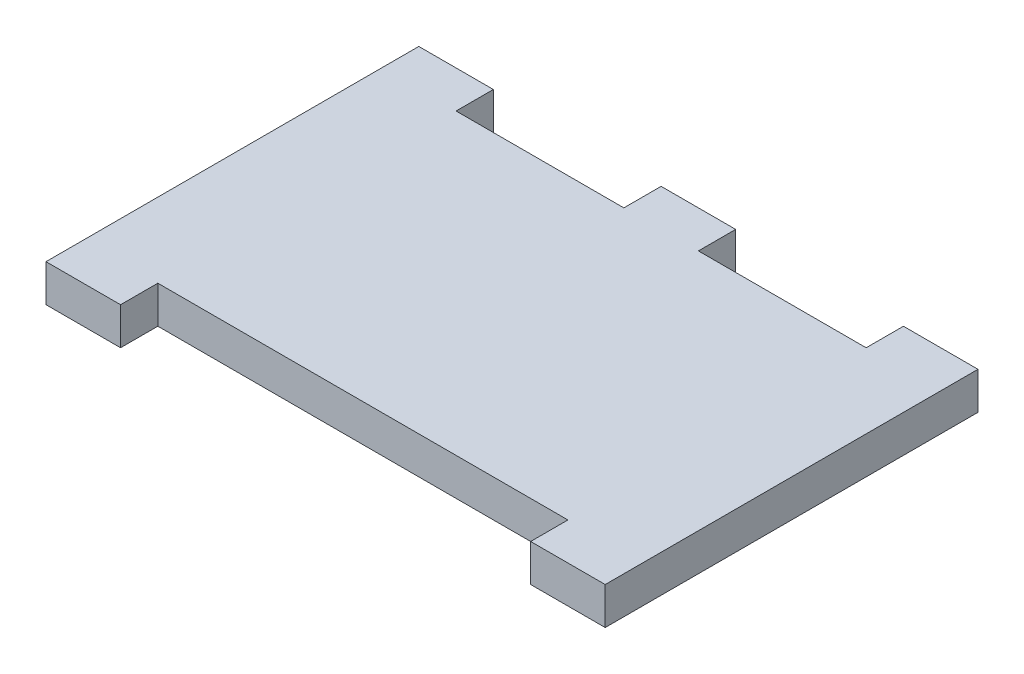
ISO-10303-21;
HEADER;
FILE_DESCRIPTION(('STEP AP214'),'2;1');
FILE_NAME('part.step','',(''),(''),'','','');
FILE_SCHEMA(('AUTOMOTIVE_DESIGN { 1 0 10303 214 1 1 1 1 }'));
ENDSEC;
DATA;
#1=APPLICATION_CONTEXT('core data for automotive mechanical design processes');
#2=APPLICATION_PROTOCOL_DEFINITION('international standard','automotive_design',2000,#1);
#3=PRODUCT_CONTEXT('',#1,'mechanical');
#4=PRODUCT('Part','Part','',(#3));
#5=PRODUCT_RELATED_PRODUCT_CATEGORY('part','',(#4));
#6=PRODUCT_DEFINITION_FORMATION('','',#4);
#7=PRODUCT_DEFINITION_CONTEXT('part definition',#1,'design');
#8=PRODUCT_DEFINITION('design','',#6,#7);
#9=PRODUCT_DEFINITION_SHAPE('','',#8);
#10=(LENGTH_UNIT() NAMED_UNIT(*) SI_UNIT(.MILLI.,.METRE.));
#11=(NAMED_UNIT(*) PLANE_ANGLE_UNIT() SI_UNIT($,.RADIAN.));
#12=(NAMED_UNIT(*) SI_UNIT($,.STERADIAN.) SOLID_ANGLE_UNIT());
#13=UNCERTAINTY_MEASURE_WITH_UNIT(LENGTH_MEASURE(1.E-05),#10,'distance_accuracy_value','');
#14=(GEOMETRIC_REPRESENTATION_CONTEXT(3) GLOBAL_UNCERTAINTY_ASSIGNED_CONTEXT((#13)) GLOBAL_UNIT_ASSIGNED_CONTEXT((#10,
#11,#12)) REPRESENTATION_CONTEXT('',''));
#15=CARTESIAN_POINT('',(0.,0.,0.));
#16=DIRECTION('',(0.,0.,1.));
#17=DIRECTION('',(1.,0.,0.));
#18=AXIS2_PLACEMENT_3D('',#15,#16,#17);
#19=CARTESIAN_POINT('',(0.,7.62,0.));
#20=DIRECTION('',(0.,0.,-1.));
#21=DIRECTION('',(-1.,0.,0.));
#22=AXIS2_PLACEMENT_3D('',#19,#20,#21);
#23=PLANE('',#22);
#24=DIRECTION('',(1.,0.,0.));
#25=VECTOR('',#24,1.);
#26=CARTESIAN_POINT('',(0.,0.,0.));
#27=LINE('',#26,#25);
#28=CARTESIAN_POINT('',(0.,0.,0.));
#29=VERTEX_POINT('',#28);
#30=CARTESIAN_POINT('',(15.24,0.,0.));
#31=VERTEX_POINT('',#30);
#32=EDGE_CURVE('E162',#29,#31,#27,.T.);
#33=ORIENTED_EDGE('',*,*,#32,.T.);
#34=DIRECTION('',(0.,1.,0.));
#35=VECTOR('',#34,1.);
#36=CARTESIAN_POINT('',(15.24,0.,0.));
#37=LINE('',#36,#35);
#38=CARTESIAN_POINT('',(15.24,7.62,0.));
#39=VERTEX_POINT('',#38);
#40=EDGE_CURVE('E146',#31,#39,#37,.T.);
#41=ORIENTED_EDGE('',*,*,#40,.T.);
#42=DIRECTION('',(1.,0.,0.));
#43=VECTOR('',#42,1.);
#44=CARTESIAN_POINT('',(0.,7.62,0.));
#45=LINE('',#44,#43);
#46=CARTESIAN_POINT('',(0.,7.62,0.));
#47=VERTEX_POINT('',#46);
#48=EDGE_CURVE('E255',#47,#39,#45,.T.);
#49=ORIENTED_EDGE('',*,*,#48,.F.);
#50=DIRECTION('',(0.,-1.,0.));
#51=VECTOR('',#50,1.);
#52=CARTESIAN_POINT('',(0.,7.62,0.));
#53=LINE('',#52,#51);
#54=EDGE_CURVE('E168',#47,#29,#53,.T.);
#55=ORIENTED_EDGE('',*,*,#54,.T.);
#56=EDGE_LOOP('',(#33,#41,#49,#55));
#57=FACE_BOUND('',#56,.T.);
#58=ADVANCED_FACE('F33',(#57),#23,.F.);
#59=CARTESIAN_POINT('',(0.,7.62,-76.2));
#60=DIRECTION('',(0.,0.,-1.));
#61=DIRECTION('',(-1.,0.,0.));
#62=AXIS2_PLACEMENT_3D('',#59,#60,#61);
#63=PLANE('',#62);
#64=DIRECTION('',(0.,1.,0.));
#65=VECTOR('',#64,1.);
#66=CARTESIAN_POINT('',(99.06,0.,-76.2));
#67=LINE('',#66,#65);
#68=CARTESIAN_POINT('',(99.06,0.,-76.2));
#69=VERTEX_POINT('',#68);
#70=CARTESIAN_POINT('',(99.06,7.62,-76.2));
#71=VERTEX_POINT('',#70);
#72=EDGE_CURVE('E227',#69,#71,#67,.T.);
#73=ORIENTED_EDGE('',*,*,#72,.T.);
#74=DIRECTION('',(1.,0.,0.));
#75=VECTOR('',#74,1.);
#76=CARTESIAN_POINT('',(0.,7.62,-76.2));
#77=LINE('',#76,#75);
#78=CARTESIAN_POINT('',(114.3,7.62,-76.2));
#79=VERTEX_POINT('',#78);
#80=EDGE_CURVE('E196',#71,#79,#77,.T.);
#81=ORIENTED_EDGE('',*,*,#80,.T.);
#82=DIRECTION('',(0.,-1.,0.));
#83=VECTOR('',#82,1.);
#84=CARTESIAN_POINT('',(114.3,7.62,-76.2));
#85=LINE('',#84,#83);
#86=CARTESIAN_POINT('',(114.3,0.,-76.2));
#87=VERTEX_POINT('',#86);
#88=EDGE_CURVE('E41',#79,#87,#85,.T.);
#89=ORIENTED_EDGE('',*,*,#88,.T.);
#90=DIRECTION('',(1.,0.,0.));
#91=VECTOR('',#90,1.);
#92=CARTESIAN_POINT('',(0.,0.,-76.2));
#93=LINE('',#92,#91);
#94=EDGE_CURVE('E173',#69,#87,#93,.T.);
#95=ORIENTED_EDGE('',*,*,#94,.F.);
#96=EDGE_LOOP('',(#73,#81,#89,#95));
#97=FACE_BOUND('',#96,.T.);
#98=ADVANCED_FACE('F194',(#97),#63,.T.);
#99=DIRECTION('',(0.,1.,0.));
#100=VECTOR('',#99,1.);
#101=CARTESIAN_POINT('',(15.24,0.,-76.2));
#102=LINE('',#101,#100);
#103=CARTESIAN_POINT('',(15.24,0.,-76.2));
#104=VERTEX_POINT('',#103);
#105=CARTESIAN_POINT('',(15.24,7.62,-76.2));
#106=VERTEX_POINT('',#105);
#107=EDGE_CURVE('E175',#104,#106,#102,.T.);
#108=ORIENTED_EDGE('',*,*,#107,.F.);
#109=CARTESIAN_POINT('',(0.,0.,-76.2));
#110=VERTEX_POINT('',#109);
#111=EDGE_CURVE('E180',#110,#104,#93,.T.);
#112=ORIENTED_EDGE('',*,*,#111,.F.);
#113=DIRECTION('',(0.,-1.,0.));
#114=VECTOR('',#113,1.);
#115=CARTESIAN_POINT('',(0.,7.62,-76.2));
#116=LINE('',#115,#114);
#117=CARTESIAN_POINT('',(0.,7.62,-76.2));
#118=VERTEX_POINT('',#117);
#119=EDGE_CURVE('E188',#118,#110,#116,.T.);
#120=ORIENTED_EDGE('',*,*,#119,.F.);
#121=EDGE_CURVE('E258',#118,#106,#77,.T.);
#122=ORIENTED_EDGE('',*,*,#121,.T.);
#123=EDGE_LOOP('',(#108,#112,#120,#122));
#124=FACE_BOUND('',#123,.T.);
#125=ADVANCED_FACE('F277',(#124),#63,.T.);
#126=CARTESIAN_POINT('',(99.06,7.62,0.));
#127=VERTEX_POINT('',#126);
#128=CARTESIAN_POINT('',(114.3,7.62,0.));
#129=VERTEX_POINT('',#128);
#130=EDGE_CURVE('E186',#127,#129,#45,.T.);
#131=ORIENTED_EDGE('',*,*,#130,.F.);
#132=DIRECTION('',(0.,1.,0.));
#133=VECTOR('',#132,1.);
#134=CARTESIAN_POINT('',(99.06,0.,0.));
#135=LINE('',#134,#133);
#136=CARTESIAN_POINT('',(99.06,0.,0.));
#137=VERTEX_POINT('',#136);
#138=EDGE_CURVE('E156',#137,#127,#135,.T.);
#139=ORIENTED_EDGE('',*,*,#138,.F.);
#140=CARTESIAN_POINT('',(114.3,0.,0.));
#141=VERTEX_POINT('',#140);
#142=EDGE_CURVE('E170',#137,#141,#27,.T.);
#143=ORIENTED_EDGE('',*,*,#142,.T.);
#144=DIRECTION('',(0.,-1.,0.));
#145=VECTOR('',#144,1.);
#146=CARTESIAN_POINT('',(114.3,7.62,0.));
#147=LINE('',#146,#145);
#148=EDGE_CURVE('E11',#129,#141,#147,.T.);
#149=ORIENTED_EDGE('',*,*,#148,.F.);
#150=EDGE_LOOP('',(#131,#139,#143,#149));
#151=FACE_BOUND('',#150,.T.);
#152=ADVANCED_FACE('F35',(#151),#23,.F.);
#153=CARTESIAN_POINT('',(114.3,7.62,0.));
#154=DIRECTION('',(-1.,0.,0.));
#155=DIRECTION('',(0.,0.,1.));
#156=AXIS2_PLACEMENT_3D('',#153,#154,#155);
#157=PLANE('',#156);
#158=DIRECTION('',(0.,0.,-1.));
#159=VECTOR('',#158,1.);
#160=CARTESIAN_POINT('',(114.3,0.,0.));
#161=LINE('',#160,#159);
#162=EDGE_CURVE('E169',#141,#87,#161,.T.);
#163=ORIENTED_EDGE('',*,*,#162,.T.);
#164=ORIENTED_EDGE('',*,*,#88,.F.);
#165=DIRECTION('',(0.,0.,-1.));
#166=VECTOR('',#165,1.);
#167=CARTESIAN_POINT('',(114.3,7.62,0.));
#168=LINE('',#167,#166);
#169=EDGE_CURVE('E257',#129,#79,#168,.T.);
#170=ORIENTED_EDGE('',*,*,#169,.F.);
#171=ORIENTED_EDGE('',*,*,#148,.T.);
#172=EDGE_LOOP('',(#163,#164,#170,#171));
#173=FACE_BOUND('',#172,.T.);
#174=ADVANCED_FACE('F201',(#173),#157,.F.);
#175=DIRECTION('',(0.,1.,0.));
#176=VECTOR('',#175,1.);
#177=CARTESIAN_POINT('',(64.77,0.,-76.2));
#178=LINE('',#177,#176);
#179=CARTESIAN_POINT('',(64.77,0.,-76.2));
#180=VERTEX_POINT('',#179);
#181=CARTESIAN_POINT('',(64.77,7.62,-76.2));
#182=VERTEX_POINT('',#181);
#183=EDGE_CURVE('E221',#180,#182,#178,.T.);
#184=ORIENTED_EDGE('',*,*,#183,.F.);
#185=CARTESIAN_POINT('',(49.53,0.,-76.2));
#186=VERTEX_POINT('',#185);
#187=EDGE_CURVE('E184',#186,#180,#93,.T.);
#188=ORIENTED_EDGE('',*,*,#187,.F.);
#189=DIRECTION('',(0.,1.,0.));
#190=VECTOR('',#189,1.);
#191=CARTESIAN_POINT('',(49.53,0.,-76.2));
#192=LINE('',#191,#190);
#193=CARTESIAN_POINT('',(49.53,7.62,-76.2));
#194=VERTEX_POINT('',#193);
#195=EDGE_CURVE('E219',#186,#194,#192,.T.);
#196=ORIENTED_EDGE('',*,*,#195,.T.);
#197=EDGE_CURVE('E222',#194,#182,#77,.T.);
#198=ORIENTED_EDGE('',*,*,#197,.T.);
#199=EDGE_LOOP('',(#184,#188,#196,#198));
#200=FACE_BOUND('',#199,.T.);
#201=ADVANCED_FACE('F217',(#200),#63,.T.);
#202=CARTESIAN_POINT('',(0.,7.62,0.));
#203=DIRECTION('',(-1.,0.,0.));
#204=DIRECTION('',(0.,0.,1.));
#205=AXIS2_PLACEMENT_3D('',#202,#203,#204);
#206=PLANE('',#205);
#207=DIRECTION('',(0.,0.,-1.));
#208=VECTOR('',#207,1.);
#209=CARTESIAN_POINT('',(0.,0.,0.));
#210=LINE('',#209,#208);
#211=EDGE_CURVE('E183',#29,#110,#210,.T.);
#212=ORIENTED_EDGE('',*,*,#211,.F.);
#213=ORIENTED_EDGE('',*,*,#54,.F.);
#214=DIRECTION('',(0.,0.,-1.));
#215=VECTOR('',#214,1.);
#216=CARTESIAN_POINT('',(0.,7.62,0.));
#217=LINE('',#216,#215);
#218=EDGE_CURVE('E177',#47,#118,#217,.T.);
#219=ORIENTED_EDGE('',*,*,#218,.T.);
#220=ORIENTED_EDGE('',*,*,#119,.T.);
#221=EDGE_LOOP('',(#212,#213,#219,#220));
#222=FACE_BOUND('',#221,.T.);
#223=ADVANCED_FACE('F266',(#222),#206,.T.);
#224=CARTESIAN_POINT('',(0.,7.62,0.));
#225=DIRECTION('',(0.,1.,0.));
#226=DIRECTION('',(0.,0.,1.));
#227=AXIS2_PLACEMENT_3D('',#224,#225,#226);
#228=PLANE('',#227);
#229=DIRECTION('',(0.,0.,-1.));
#230=VECTOR('',#229,1.);
#231=CARTESIAN_POINT('',(99.06,7.62,-68.58));
#232=LINE('',#231,#230);
#233=CARTESIAN_POINT('',(99.06,7.62,-68.58));
#234=VERTEX_POINT('',#233);
#235=EDGE_CURVE('E287',#234,#71,#232,.T.);
#236=ORIENTED_EDGE('',*,*,#235,.F.);
#237=DIRECTION('',(1.,0.,0.));
#238=VECTOR('',#237,1.);
#239=CARTESIAN_POINT('',(64.77,7.62,-68.58));
#240=LINE('',#239,#238);
#241=CARTESIAN_POINT('',(64.77,7.62,-68.58));
#242=VERTEX_POINT('',#241);
#243=EDGE_CURVE('E286',#242,#234,#240,.T.);
#244=ORIENTED_EDGE('',*,*,#243,.F.);
#245=DIRECTION('',(0.,0.,1.));
#246=VECTOR('',#245,1.);
#247=CARTESIAN_POINT('',(64.77,7.62,-68.58));
#248=LINE('',#247,#246);
#249=EDGE_CURVE('E284',#182,#242,#248,.T.);
#250=ORIENTED_EDGE('',*,*,#249,.F.);
#251=ORIENTED_EDGE('',*,*,#197,.F.);
#252=DIRECTION('',(0.,0.,-1.));
#253=VECTOR('',#252,1.);
#254=CARTESIAN_POINT('',(49.53,7.62,-76.2));
#255=LINE('',#254,#253);
#256=CARTESIAN_POINT('',(49.53,7.62,-68.58));
#257=VERTEX_POINT('',#256);
#258=EDGE_CURVE('E238',#257,#194,#255,.T.);
#259=ORIENTED_EDGE('',*,*,#258,.F.);
#260=DIRECTION('',(1.,0.,0.));
#261=VECTOR('',#260,1.);
#262=CARTESIAN_POINT('',(49.53,7.62,-68.58));
#263=LINE('',#262,#261);
#264=CARTESIAN_POINT('',(15.24,7.62,-68.58));
#265=VERTEX_POINT('',#264);
#266=EDGE_CURVE('E245',#265,#257,#263,.T.);
#267=ORIENTED_EDGE('',*,*,#266,.F.);
#268=DIRECTION('',(0.,0.,1.));
#269=VECTOR('',#268,1.);
#270=CARTESIAN_POINT('',(15.24,7.62,-76.2));
#271=LINE('',#270,#269);
#272=EDGE_CURVE('E242',#106,#265,#271,.T.);
#273=ORIENTED_EDGE('',*,*,#272,.F.);
#274=ORIENTED_EDGE('',*,*,#121,.F.);
#275=ORIENTED_EDGE('',*,*,#218,.F.);
#276=ORIENTED_EDGE('',*,*,#48,.T.);
#277=DIRECTION('',(0.,0.,1.));
#278=VECTOR('',#277,1.);
#279=CARTESIAN_POINT('',(15.24,7.62,0.));
#280=LINE('',#279,#278);
#281=CARTESIAN_POINT('',(15.24,7.62,-7.62000000000001));
#282=VERTEX_POINT('',#281);
#283=EDGE_CURVE('E151',#282,#39,#280,.T.);
#284=ORIENTED_EDGE('',*,*,#283,.F.);
#285=DIRECTION('',(-1.,0.,0.));
#286=VECTOR('',#285,1.);
#287=CARTESIAN_POINT('',(15.24,7.62,-7.62000000000001));
#288=LINE('',#287,#286);
#289=CARTESIAN_POINT('',(99.06,7.62,-7.62000000000001));
#290=VERTEX_POINT('',#289);
#291=EDGE_CURVE('E166',#290,#282,#288,.T.);
#292=ORIENTED_EDGE('',*,*,#291,.F.);
#293=DIRECTION('',(0.,0.,-1.));
#294=VECTOR('',#293,1.);
#295=CARTESIAN_POINT('',(99.06,7.62,0.));
#296=LINE('',#295,#294);
#297=EDGE_CURVE('E293',#127,#290,#296,.T.);
#298=ORIENTED_EDGE('',*,*,#297,.F.);
#299=ORIENTED_EDGE('',*,*,#130,.T.);
#300=ORIENTED_EDGE('',*,*,#169,.T.);
#301=ORIENTED_EDGE('',*,*,#80,.F.);
#302=EDGE_LOOP('',(#236,#244,#250,#251,#259,#267,#273,#274,#275,#276,#284,#292,#298,#299,#300,#301));
#303=FACE_BOUND('',#302,.T.);
#304=ADVANCED_FACE('F270',(#303),#228,.T.);
#305=CARTESIAN_POINT('',(0.,0.,0.));
#306=DIRECTION('',(0.,1.,0.));
#307=DIRECTION('',(0.,0.,1.));
#308=AXIS2_PLACEMENT_3D('',#305,#306,#307);
#309=PLANE('',#308);
#310=DIRECTION('',(1.,0.,0.));
#311=VECTOR('',#310,1.);
#312=CARTESIAN_POINT('',(64.77,0.,-68.58));
#313=LINE('',#312,#311);
#314=CARTESIAN_POINT('',(64.77,0.,-68.58));
#315=VERTEX_POINT('',#314);
#316=CARTESIAN_POINT('',(99.06,0.,-68.58));
#317=VERTEX_POINT('',#316);
#318=EDGE_CURVE('E48',#315,#317,#313,.T.);
#319=ORIENTED_EDGE('',*,*,#318,.T.);
#320=DIRECTION('',(0.,0.,-1.));
#321=VECTOR('',#320,1.);
#322=CARTESIAN_POINT('',(99.06,0.,-68.58));
#323=LINE('',#322,#321);
#324=EDGE_CURVE('E206',#317,#69,#323,.T.);
#325=ORIENTED_EDGE('',*,*,#324,.T.);
#326=ORIENTED_EDGE('',*,*,#94,.T.);
#327=ORIENTED_EDGE('',*,*,#162,.F.);
#328=ORIENTED_EDGE('',*,*,#142,.F.);
#329=DIRECTION('',(0.,0.,-1.));
#330=VECTOR('',#329,1.);
#331=CARTESIAN_POINT('',(99.06,0.,0.));
#332=LINE('',#331,#330);
#333=CARTESIAN_POINT('',(99.06,0.,-7.62000000000001));
#334=VERTEX_POINT('',#333);
#335=EDGE_CURVE('E165',#137,#334,#332,.T.);
#336=ORIENTED_EDGE('',*,*,#335,.T.);
#337=DIRECTION('',(-1.,0.,0.));
#338=VECTOR('',#337,1.);
#339=CARTESIAN_POINT('',(15.24,0.,-7.62000000000001));
#340=LINE('',#339,#338);
#341=CARTESIAN_POINT('',(15.24,0.,-7.62000000000001));
#342=VERTEX_POINT('',#341);
#343=EDGE_CURVE('E56',#334,#342,#340,.T.);
#344=ORIENTED_EDGE('',*,*,#343,.T.);
#345=DIRECTION('',(0.,0.,1.));
#346=VECTOR('',#345,1.);
#347=CARTESIAN_POINT('',(15.24,0.,0.));
#348=LINE('',#347,#346);
#349=EDGE_CURVE('E149',#342,#31,#348,.T.);
#350=ORIENTED_EDGE('',*,*,#349,.T.);
#351=ORIENTED_EDGE('',*,*,#32,.F.);
#352=ORIENTED_EDGE('',*,*,#211,.T.);
#353=ORIENTED_EDGE('',*,*,#111,.T.);
#354=DIRECTION('',(0.,0.,1.));
#355=VECTOR('',#354,1.);
#356=CARTESIAN_POINT('',(15.24,0.,-76.2));
#357=LINE('',#356,#355);
#358=CARTESIAN_POINT('',(15.24,0.,-68.58));
#359=VERTEX_POINT('',#358);
#360=EDGE_CURVE('E234',#104,#359,#357,.T.);
#361=ORIENTED_EDGE('',*,*,#360,.T.);
#362=DIRECTION('',(1.,0.,0.));
#363=VECTOR('',#362,1.);
#364=CARTESIAN_POINT('',(49.53,0.,-68.58));
#365=LINE('',#364,#363);
#366=CARTESIAN_POINT('',(49.53,0.,-68.58));
#367=VERTEX_POINT('',#366);
#368=EDGE_CURVE('E237',#359,#367,#365,.T.);
#369=ORIENTED_EDGE('',*,*,#368,.T.);
#370=DIRECTION('',(0.,0.,-1.));
#371=VECTOR('',#370,1.);
#372=CARTESIAN_POINT('',(49.53,0.,-76.2));
#373=LINE('',#372,#371);
#374=EDGE_CURVE('E213',#367,#186,#373,.T.);
#375=ORIENTED_EDGE('',*,*,#374,.T.);
#376=ORIENTED_EDGE('',*,*,#187,.T.);
#377=DIRECTION('',(0.,0.,1.));
#378=VECTOR('',#377,1.);
#379=CARTESIAN_POINT('',(64.77,0.,-68.58));
#380=LINE('',#379,#378);
#381=EDGE_CURVE('E211',#180,#315,#380,.T.);
#382=ORIENTED_EDGE('',*,*,#381,.T.);
#383=EDGE_LOOP('',(#319,#325,#326,#327,#328,#336,#344,#350,#351,#352,#353,#361,#369,#375,#376,#382));
#384=FACE_BOUND('',#383,.T.);
#385=ADVANCED_FACE('F160',(#384),#309,.F.);
#386=CARTESIAN_POINT('',(15.24,0.,-76.2));
#387=DIRECTION('',(-1.,0.,0.));
#388=DIRECTION('',(0.,0.,1.));
#389=AXIS2_PLACEMENT_3D('',#386,#387,#388);
#390=PLANE('',#389);
#391=ORIENTED_EDGE('',*,*,#272,.T.);
#392=DIRECTION('',(0.,1.,0.));
#393=VECTOR('',#392,1.);
#394=CARTESIAN_POINT('',(15.24,0.,-68.58));
#395=LINE('',#394,#393);
#396=EDGE_CURVE('E241',#359,#265,#395,.T.);
#397=ORIENTED_EDGE('',*,*,#396,.F.);
#398=ORIENTED_EDGE('',*,*,#360,.F.);
#399=ORIENTED_EDGE('',*,*,#107,.T.);
#400=EDGE_LOOP('',(#391,#397,#398,#399));
#401=FACE_BOUND('',#400,.T.);
#402=ADVANCED_FACE('F275',(#401),#390,.F.);
#403=CARTESIAN_POINT('',(49.53,0.,-76.2));
#404=DIRECTION('',(1.,0.,0.));
#405=DIRECTION('',(0.,0.,-1.));
#406=AXIS2_PLACEMENT_3D('',#403,#404,#405);
#407=PLANE('',#406);
#408=ORIENTED_EDGE('',*,*,#258,.T.);
#409=ORIENTED_EDGE('',*,*,#195,.F.);
#410=ORIENTED_EDGE('',*,*,#374,.F.);
#411=DIRECTION('',(0.,1.,0.));
#412=VECTOR('',#411,1.);
#413=CARTESIAN_POINT('',(49.53,0.,-68.58));
#414=LINE('',#413,#412);
#415=EDGE_CURVE('E252',#367,#257,#414,.T.);
#416=ORIENTED_EDGE('',*,*,#415,.T.);
#417=EDGE_LOOP('',(#408,#409,#410,#416));
#418=FACE_BOUND('',#417,.T.);
#419=ADVANCED_FACE('F282',(#418),#407,.F.);
#420=CARTESIAN_POINT('',(49.53,0.,-68.58));
#421=DIRECTION('',(0.,0.,1.));
#422=DIRECTION('',(1.,0.,0.));
#423=AXIS2_PLACEMENT_3D('',#420,#421,#422);
#424=PLANE('',#423);
#425=ORIENTED_EDGE('',*,*,#266,.T.);
#426=ORIENTED_EDGE('',*,*,#415,.F.);
#427=ORIENTED_EDGE('',*,*,#368,.F.);
#428=ORIENTED_EDGE('',*,*,#396,.T.);
#429=EDGE_LOOP('',(#425,#426,#427,#428));
#430=FACE_BOUND('',#429,.T.);
#431=ADVANCED_FACE('F280',(#430),#424,.F.);
#432=CARTESIAN_POINT('',(15.24,0.,0.));
#433=DIRECTION('',(-1.,0.,0.));
#434=DIRECTION('',(0.,0.,1.));
#435=AXIS2_PLACEMENT_3D('',#432,#433,#434);
#436=PLANE('',#435);
#437=ORIENTED_EDGE('',*,*,#283,.T.);
#438=ORIENTED_EDGE('',*,*,#40,.F.);
#439=ORIENTED_EDGE('',*,*,#349,.F.);
#440=DIRECTION('',(0.,1.,0.));
#441=VECTOR('',#440,1.);
#442=CARTESIAN_POINT('',(15.24,0.,-7.62000000000001));
#443=LINE('',#442,#441);
#444=EDGE_CURVE('E246',#342,#282,#443,.T.);
#445=ORIENTED_EDGE('',*,*,#444,.T.);
#446=EDGE_LOOP('',(#437,#438,#439,#445));
#447=FACE_BOUND('',#446,.T.);
#448=ADVANCED_FACE('F148',(#447),#436,.F.);
#449=CARTESIAN_POINT('',(15.24,0.,-7.62000000000001));
#450=DIRECTION('',(0.,0.,-1.));
#451=DIRECTION('',(-1.,0.,0.));
#452=AXIS2_PLACEMENT_3D('',#449,#450,#451);
#453=PLANE('',#452);
#454=ORIENTED_EDGE('',*,*,#291,.T.);
#455=ORIENTED_EDGE('',*,*,#444,.F.);
#456=ORIENTED_EDGE('',*,*,#343,.F.);
#457=DIRECTION('',(0.,1.,0.));
#458=VECTOR('',#457,1.);
#459=CARTESIAN_POINT('',(99.06,0.,-7.62000000000001));
#460=LINE('',#459,#458);
#461=EDGE_CURVE('E303',#334,#290,#460,.T.);
#462=ORIENTED_EDGE('',*,*,#461,.T.);
#463=EDGE_LOOP('',(#454,#455,#456,#462));
#464=FACE_BOUND('',#463,.T.);
#465=ADVANCED_FACE('F355',(#464),#453,.F.);
#466=CARTESIAN_POINT('',(99.06,0.,0.));
#467=DIRECTION('',(1.,0.,0.));
#468=DIRECTION('',(0.,0.,-1.));
#469=AXIS2_PLACEMENT_3D('',#466,#467,#468);
#470=PLANE('',#469);
#471=ORIENTED_EDGE('',*,*,#297,.T.);
#472=ORIENTED_EDGE('',*,*,#461,.F.);
#473=ORIENTED_EDGE('',*,*,#335,.F.);
#474=ORIENTED_EDGE('',*,*,#138,.T.);
#475=EDGE_LOOP('',(#471,#472,#473,#474));
#476=FACE_BOUND('',#475,.T.);
#477=ADVANCED_FACE('F310',(#476),#470,.F.);
#478=CARTESIAN_POINT('',(99.06,0.,-68.58));
#479=DIRECTION('',(1.,0.,0.));
#480=DIRECTION('',(0.,0.,-1.));
#481=AXIS2_PLACEMENT_3D('',#478,#479,#480);
#482=PLANE('',#481);
#483=ORIENTED_EDGE('',*,*,#235,.T.);
#484=ORIENTED_EDGE('',*,*,#72,.F.);
#485=ORIENTED_EDGE('',*,*,#324,.F.);
#486=DIRECTION('',(0.,1.,0.));
#487=VECTOR('',#486,1.);
#488=CARTESIAN_POINT('',(99.06,0.,-68.58));
#489=LINE('',#488,#487);
#490=EDGE_CURVE('E229',#317,#234,#489,.T.);
#491=ORIENTED_EDGE('',*,*,#490,.T.);
#492=EDGE_LOOP('',(#483,#484,#485,#491));
#493=FACE_BOUND('',#492,.T.);
#494=ADVANCED_FACE('F344',(#493),#482,.F.);
#495=CARTESIAN_POINT('',(64.77,0.,-68.58));
#496=DIRECTION('',(0.,0.,1.));
#497=DIRECTION('',(1.,0.,0.));
#498=AXIS2_PLACEMENT_3D('',#495,#496,#497);
#499=PLANE('',#498);
#500=ORIENTED_EDGE('',*,*,#243,.T.);
#501=ORIENTED_EDGE('',*,*,#490,.F.);
#502=ORIENTED_EDGE('',*,*,#318,.F.);
#503=DIRECTION('',(0.,1.,0.));
#504=VECTOR('',#503,1.);
#505=CARTESIAN_POINT('',(64.77,0.,-68.58));
#506=LINE('',#505,#504);
#507=EDGE_CURVE('E226',#315,#242,#506,.T.);
#508=ORIENTED_EDGE('',*,*,#507,.T.);
#509=EDGE_LOOP('',(#500,#501,#502,#508));
#510=FACE_BOUND('',#509,.T.);
#511=ADVANCED_FACE('F347',(#510),#499,.F.);
#512=CARTESIAN_POINT('',(64.77,0.,-68.58));
#513=DIRECTION('',(-1.,0.,0.));
#514=DIRECTION('',(0.,0.,1.));
#515=AXIS2_PLACEMENT_3D('',#512,#513,#514);
#516=PLANE('',#515);
#517=ORIENTED_EDGE('',*,*,#249,.T.);
#518=ORIENTED_EDGE('',*,*,#507,.F.);
#519=ORIENTED_EDGE('',*,*,#381,.F.);
#520=ORIENTED_EDGE('',*,*,#183,.T.);
#521=EDGE_LOOP('',(#517,#518,#519,#520));
#522=FACE_BOUND('',#521,.T.);
#523=ADVANCED_FACE('F348',(#522),#516,.F.);
#524=CLOSED_SHELL('',(#58,#98,#125,#152,#174,#201,#223,#304,#385,#402,#419,#431,#448,#465,#477,
#494,#511,#523));
#525=MANIFOLD_SOLID_BREP('B2',#524);
#526=ADVANCED_BREP_SHAPE_REPRESENTATION('',(#18,#525),#14);
#527=SHAPE_DEFINITION_REPRESENTATION(#9,#526);
ENDSEC;
END-ISO-10303-21;
